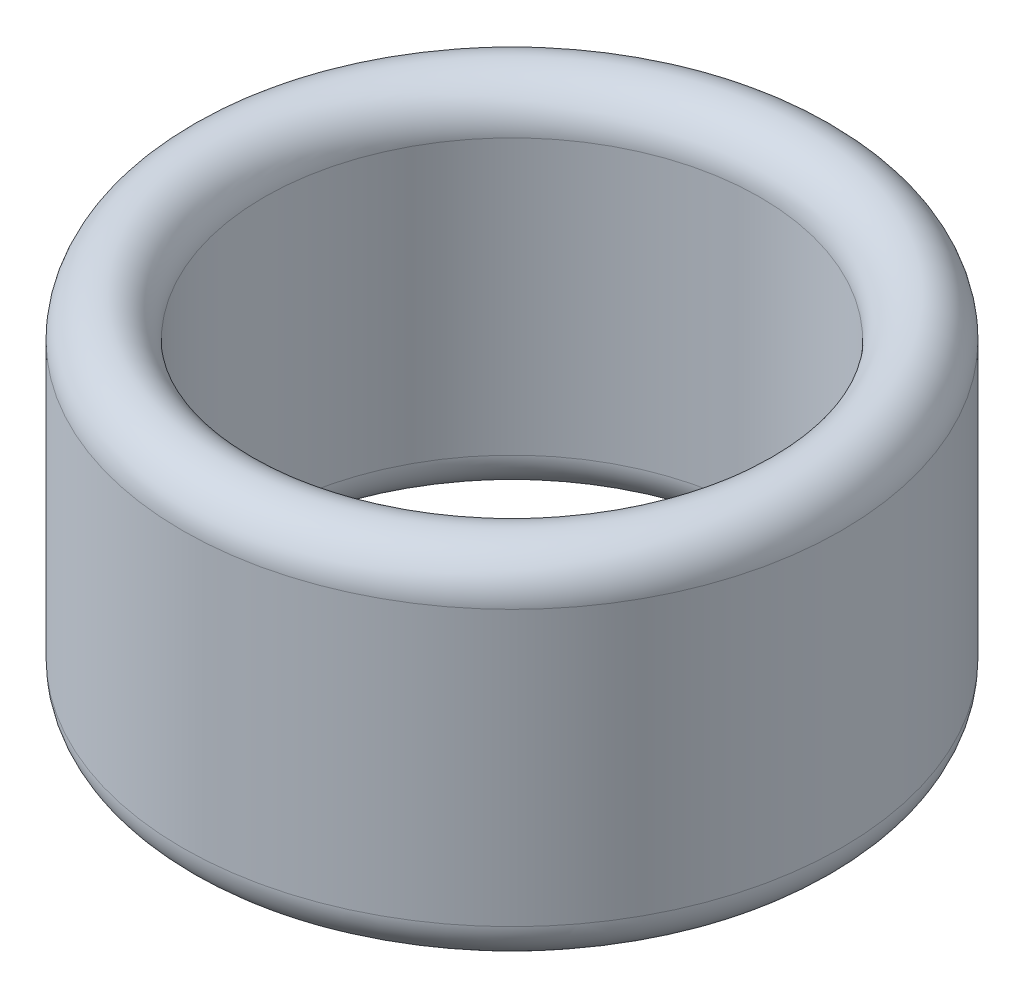
ISO-10303-21;
HEADER;
FILE_DESCRIPTION(('STEP AP214'),'2;1');
FILE_NAME('part.step','',(''),(''),'','','');
FILE_SCHEMA(('AUTOMOTIVE_DESIGN { 1 0 10303 214 1 1 1 1 }'));
ENDSEC;
DATA;
#1=APPLICATION_CONTEXT('core data for automotive mechanical design processes');
#2=APPLICATION_PROTOCOL_DEFINITION('international standard','automotive_design',2000,#1);
#3=PRODUCT_CONTEXT('',#1,'mechanical');
#4=PRODUCT('Part','Part','',(#3));
#5=PRODUCT_RELATED_PRODUCT_CATEGORY('part','',(#4));
#6=PRODUCT_DEFINITION_FORMATION('','',#4);
#7=PRODUCT_DEFINITION_CONTEXT('part definition',#1,'design');
#8=PRODUCT_DEFINITION('design','',#6,#7);
#9=PRODUCT_DEFINITION_SHAPE('','',#8);
#10=(LENGTH_UNIT() NAMED_UNIT(*) SI_UNIT(.MILLI.,.METRE.));
#11=(NAMED_UNIT(*) PLANE_ANGLE_UNIT() SI_UNIT($,.RADIAN.));
#12=(NAMED_UNIT(*) SI_UNIT($,.STERADIAN.) SOLID_ANGLE_UNIT());
#13=UNCERTAINTY_MEASURE_WITH_UNIT(LENGTH_MEASURE(1.E-05),#10,'distance_accuracy_value','');
#14=(GEOMETRIC_REPRESENTATION_CONTEXT(3) GLOBAL_UNCERTAINTY_ASSIGNED_CONTEXT((#13)) GLOBAL_UNIT_ASSIGNED_CONTEXT((#10,
#11,#12)) REPRESENTATION_CONTEXT('',''));
#15=CARTESIAN_POINT('',(0.,0.,0.));
#16=DIRECTION('',(0.,0.,1.));
#17=DIRECTION('',(1.,0.,0.));
#18=AXIS2_PLACEMENT_3D('',#15,#16,#17);
#19=CARTESIAN_POINT('',(0.,0.4445,0.));
#20=DIRECTION('',(0.,1.,0.));
#21=DIRECTION('',(0.,0.,1.));
#22=AXIS2_PLACEMENT_3D('',#19,#20,#21);
#23=TOROIDAL_SURFACE('',#22,3.1496,0.4445);
#24=CARTESIAN_POINT('',(0.,0.4445,0.));
#25=DIRECTION('',(0.,1.,0.));
#26=DIRECTION('',(0.,0.,1.));
#27=AXIS2_PLACEMENT_3D('',#24,#25,#26);
#28=CIRCLE('',#27,3.5941);
#29=CARTESIAN_POINT('',(0.,0.4445,-3.5941));
#30=VERTEX_POINT('',#29);
#31=EDGE_CURVE('E57',#30,#30,#28,.T.);
#32=ORIENTED_EDGE('',*,*,#31,.F.);
#33=EDGE_LOOP('',(#32));
#34=FACE_BOUND('',#33,.T.);
#35=CARTESIAN_POINT('',(0.,0.4445,0.));
#36=DIRECTION('',(0.,1.,0.));
#37=DIRECTION('',(0.,0.,1.));
#38=AXIS2_PLACEMENT_3D('',#35,#36,#37);
#39=CIRCLE('',#38,2.7051);
#40=CARTESIAN_POINT('',(0.,0.4445,2.7051));
#41=VERTEX_POINT('',#40);
#42=EDGE_CURVE('E12',#41,#41,#39,.F.);
#43=ORIENTED_EDGE('',*,*,#42,.F.);
#44=EDGE_LOOP('',(#43));
#45=FACE_BOUND('',#44,.T.);
#46=ADVANCED_FACE('F50',(#34,#45),#23,.T.);
#47=CARTESIAN_POINT('',(0.,3.4417,0.));
#48=DIRECTION('',(0.,1.,0.));
#49=DIRECTION('',(0.,0.,1.));
#50=AXIS2_PLACEMENT_3D('',#47,#48,#49);
#51=TOROIDAL_SURFACE('',#50,3.1496,0.4445);
#52=CARTESIAN_POINT('',(0.,3.4417,0.));
#53=DIRECTION('',(0.,1.,0.));
#54=DIRECTION('',(0.,0.,1.));
#55=AXIS2_PLACEMENT_3D('',#52,#53,#54);
#56=CIRCLE('',#55,2.7051);
#57=CARTESIAN_POINT('',(0.,3.4417,2.7051));
#58=VERTEX_POINT('',#57);
#59=EDGE_CURVE('E65',#58,#58,#56,.T.);
#60=ORIENTED_EDGE('',*,*,#59,.F.);
#61=EDGE_LOOP('',(#60));
#62=FACE_BOUND('',#61,.T.);
#63=CARTESIAN_POINT('',(0.,3.4417,0.));
#64=DIRECTION('',(0.,1.,0.));
#65=DIRECTION('',(0.,0.,1.));
#66=AXIS2_PLACEMENT_3D('',#63,#64,#65);
#67=CIRCLE('',#66,3.5941);
#68=CARTESIAN_POINT('',(0.,3.4417,-3.5941));
#69=VERTEX_POINT('',#68);
#70=EDGE_CURVE('E61',#69,#69,#67,.F.);
#71=ORIENTED_EDGE('',*,*,#70,.F.);
#72=EDGE_LOOP('',(#71));
#73=FACE_BOUND('',#72,.T.);
#74=ADVANCED_FACE('F73',(#62,#73),#51,.T.);
#75=CARTESIAN_POINT('',(0.,3.8862,0.));
#76=DIRECTION('',(0.,-1.,0.));
#77=DIRECTION('',(0.,0.,-1.));
#78=AXIS2_PLACEMENT_3D('',#75,#76,#77);
#79=CYLINDRICAL_SURFACE('',#78,3.5941);
#80=CARTESIAN_POINT('',(0.,0.4445,-3.5941));
#81=CARTESIAN_POINT('',(0.,0.475720833333333,-3.5941));
#82=CARTESIAN_POINT('',(0.,0.506941666666666,-3.5941));
#83=CARTESIAN_POINT('',(0.,0.569383333333333,-3.5941));
#84=CARTESIAN_POINT('',(0.,0.600604166666666,-3.5941));
#85=CARTESIAN_POINT('',(0.,0.663045833333333,-3.5941));
#86=CARTESIAN_POINT('',(0.,0.694266666666666,-3.5941));
#87=CARTESIAN_POINT('',(0.,0.756708333333333,-3.5941));
#88=CARTESIAN_POINT('',(0.,0.787929166666666,-3.5941));
#89=CARTESIAN_POINT('',(0.,0.850370833333333,-3.5941));
#90=CARTESIAN_POINT('',(0.,0.881591666666666,-3.5941));
#91=CARTESIAN_POINT('',(0.,0.944033333333333,-3.5941));
#92=CARTESIAN_POINT('',(0.,0.975254166666666,-3.5941));
#93=CARTESIAN_POINT('',(0.,1.03769583333333,-3.5941));
#94=CARTESIAN_POINT('',(0.,1.06891666666667,-3.5941));
#95=CARTESIAN_POINT('',(0.,1.13135833333333,-3.5941));
#96=CARTESIAN_POINT('',(0.,1.16257916666667,-3.5941));
#97=CARTESIAN_POINT('',(0.,1.22502083333333,-3.5941));
#98=CARTESIAN_POINT('',(0.,1.25624166666667,-3.5941));
#99=CARTESIAN_POINT('',(0.,1.31868333333333,-3.5941));
#100=CARTESIAN_POINT('',(0.,1.34990416666667,-3.5941));
#101=CARTESIAN_POINT('',(0.,1.41234583333333,-3.5941));
#102=CARTESIAN_POINT('',(0.,1.44356666666667,-3.5941));
#103=CARTESIAN_POINT('',(0.,1.50600833333333,-3.5941));
#104=CARTESIAN_POINT('',(0.,1.53722916666667,-3.5941));
#105=CARTESIAN_POINT('',(0.,1.59967083333333,-3.5941));
#106=CARTESIAN_POINT('',(0.,1.63089166666667,-3.5941));
#107=CARTESIAN_POINT('',(0.,1.69333333333333,-3.5941));
#108=CARTESIAN_POINT('',(0.,1.72455416666667,-3.5941));
#109=CARTESIAN_POINT('',(0.,1.78699583333333,-3.5941));
#110=CARTESIAN_POINT('',(0.,1.81821666666667,-3.5941));
#111=CARTESIAN_POINT('',(0.,1.88065833333333,-3.5941));
#112=CARTESIAN_POINT('',(0.,1.91187916666667,-3.5941));
#113=CARTESIAN_POINT('',(0.,1.97432083333333,-3.5941));
#114=CARTESIAN_POINT('',(0.,2.00554166666667,-3.5941));
#115=CARTESIAN_POINT('',(0.,2.06798333333333,-3.5941));
#116=CARTESIAN_POINT('',(0.,2.09920416666667,-3.5941));
#117=CARTESIAN_POINT('',(0.,2.16164583333333,-3.5941));
#118=CARTESIAN_POINT('',(0.,2.19286666666667,-3.5941));
#119=CARTESIAN_POINT('',(0.,2.25530833333333,-3.5941));
#120=CARTESIAN_POINT('',(0.,2.28652916666667,-3.5941));
#121=CARTESIAN_POINT('',(0.,2.34897083333333,-3.5941));
#122=CARTESIAN_POINT('',(0.,2.38019166666667,-3.5941));
#123=CARTESIAN_POINT('',(0.,2.44263333333333,-3.5941));
#124=CARTESIAN_POINT('',(0.,2.47385416666667,-3.5941));
#125=CARTESIAN_POINT('',(0.,2.53629583333333,-3.5941));
#126=CARTESIAN_POINT('',(0.,2.56751666666667,-3.5941));
#127=CARTESIAN_POINT('',(0.,2.62995833333333,-3.5941));
#128=CARTESIAN_POINT('',(0.,2.66117916666667,-3.5941));
#129=CARTESIAN_POINT('',(0.,2.72362083333333,-3.5941));
#130=CARTESIAN_POINT('',(0.,2.75484166666667,-3.5941));
#131=CARTESIAN_POINT('',(0.,2.81728333333333,-3.5941));
#132=CARTESIAN_POINT('',(0.,2.84850416666667,-3.5941));
#133=CARTESIAN_POINT('',(0.,2.91094583333333,-3.5941));
#134=CARTESIAN_POINT('',(0.,2.94216666666667,-3.5941));
#135=CARTESIAN_POINT('',(0.,3.00460833333333,-3.5941));
#136=CARTESIAN_POINT('',(0.,3.03582916666667,-3.5941));
#137=CARTESIAN_POINT('',(0.,3.09827083333333,-3.5941));
#138=CARTESIAN_POINT('',(0.,3.12949166666667,-3.5941));
#139=CARTESIAN_POINT('',(0.,3.19193333333333,-3.5941));
#140=CARTESIAN_POINT('',(0.,3.22315416666667,-3.5941));
#141=CARTESIAN_POINT('',(0.,3.28559583333333,-3.5941));
#142=CARTESIAN_POINT('',(0.,3.31681666666667,-3.5941));
#143=CARTESIAN_POINT('',(0.,3.37925833333333,-3.5941));
#144=CARTESIAN_POINT('',(0.,3.41047916666667,-3.5941));
#145=CARTESIAN_POINT('',(0.,3.4417,-3.5941));
#146=B_SPLINE_CURVE_WITH_KNOTS('',3,(#80,#81,#82,#83,#84,#85,#86,#87,#88,#89,#90,#91,#92,#93,
#94,#95,#96,#97,#98,#99,#100,#101,#102,#103,#104,#105,#106,#107,#108,#109,#110,#111,#112,#113,
#114,#115,#116,#117,#118,#119,#120,#121,#122,#123,#124,#125,#126,#127,#128,#129,#130,#131,#132,
#133,#134,#135,#136,#137,#138,#139,#140,#141,#142,#143,#144,#145),.UNSPECIFIED.,.F.,.F.,(4,2,2,
2,2,2,2,2,2,2,2,2,2,2,2,2,2,2,2,2,2,2,2,2,2,2,2,2,2,2,2,2,4),(0.,0.0936625000000002,0.187325,
0.2809875,0.37465,0.4683125,0.561975,0.6556375,0.7493,0.8429625,0.936625,1.0302875,1.12395,
1.2176125,1.311275,1.4049375,1.4986,1.5922625,1.685925,1.7795875,1.87325,1.9669125,2.060575,
2.1542375,2.2479,2.3415625,2.435225,2.5288875,2.62255,2.7162125,2.809875,2.9035375,2.9972),.UNSPECIFIED.);
#147=EDGE_CURVE('BSEAM76',#30,#69,#146,.T.);
#148=ORIENTED_EDGE('',*,*,#31,.T.);
#149=ORIENTED_EDGE('',*,*,#70,.T.);
#150=ORIENTED_EDGE('',*,*,#147,.T.);
#151=ORIENTED_EDGE('',*,*,#147,.F.);
#152=EDGE_LOOP('',(#148,#150,#149,#151));
#153=FACE_BOUND('',#152,.T.);
#154=ADVANCED_FACE('F76',(#153),#79,.T.);
#155=CARTESIAN_POINT('',(0.,0.,0.));
#156=DIRECTION('',(0.,1.,0.));
#157=DIRECTION('',(0.,0.,1.));
#158=AXIS2_PLACEMENT_3D('',#155,#156,#157);
#159=CYLINDRICAL_SURFACE('',#158,2.7051);
#160=CARTESIAN_POINT('',(0.,0.4445,2.7051));
#161=CARTESIAN_POINT('',(0.,0.475720833333333,2.7051));
#162=CARTESIAN_POINT('',(0.,0.506941666666666,2.7051));
#163=CARTESIAN_POINT('',(0.,0.569383333333333,2.7051));
#164=CARTESIAN_POINT('',(0.,0.600604166666666,2.7051));
#165=CARTESIAN_POINT('',(0.,0.663045833333333,2.7051));
#166=CARTESIAN_POINT('',(0.,0.694266666666666,2.7051));
#167=CARTESIAN_POINT('',(0.,0.756708333333333,2.7051));
#168=CARTESIAN_POINT('',(0.,0.787929166666666,2.7051));
#169=CARTESIAN_POINT('',(0.,0.850370833333333,2.7051));
#170=CARTESIAN_POINT('',(0.,0.881591666666666,2.7051));
#171=CARTESIAN_POINT('',(0.,0.944033333333333,2.7051));
#172=CARTESIAN_POINT('',(0.,0.975254166666666,2.7051));
#173=CARTESIAN_POINT('',(0.,1.03769583333333,2.7051));
#174=CARTESIAN_POINT('',(0.,1.06891666666667,2.7051));
#175=CARTESIAN_POINT('',(0.,1.13135833333333,2.7051));
#176=CARTESIAN_POINT('',(0.,1.16257916666667,2.7051));
#177=CARTESIAN_POINT('',(0.,1.22502083333333,2.7051));
#178=CARTESIAN_POINT('',(0.,1.25624166666667,2.7051));
#179=CARTESIAN_POINT('',(0.,1.31868333333333,2.7051));
#180=CARTESIAN_POINT('',(0.,1.34990416666667,2.7051));
#181=CARTESIAN_POINT('',(0.,1.41234583333333,2.7051));
#182=CARTESIAN_POINT('',(0.,1.44356666666667,2.7051));
#183=CARTESIAN_POINT('',(0.,1.50600833333333,2.7051));
#184=CARTESIAN_POINT('',(0.,1.53722916666667,2.7051));
#185=CARTESIAN_POINT('',(0.,1.59967083333333,2.7051));
#186=CARTESIAN_POINT('',(0.,1.63089166666667,2.7051));
#187=CARTESIAN_POINT('',(0.,1.69333333333333,2.7051));
#188=CARTESIAN_POINT('',(0.,1.72455416666667,2.7051));
#189=CARTESIAN_POINT('',(0.,1.78699583333333,2.7051));
#190=CARTESIAN_POINT('',(0.,1.81821666666667,2.7051));
#191=CARTESIAN_POINT('',(0.,1.88065833333333,2.7051));
#192=CARTESIAN_POINT('',(0.,1.91187916666667,2.7051));
#193=CARTESIAN_POINT('',(0.,1.97432083333333,2.7051));
#194=CARTESIAN_POINT('',(0.,2.00554166666667,2.7051));
#195=CARTESIAN_POINT('',(0.,2.06798333333333,2.7051));
#196=CARTESIAN_POINT('',(0.,2.09920416666667,2.7051));
#197=CARTESIAN_POINT('',(0.,2.16164583333333,2.7051));
#198=CARTESIAN_POINT('',(0.,2.19286666666667,2.7051));
#199=CARTESIAN_POINT('',(0.,2.25530833333333,2.7051));
#200=CARTESIAN_POINT('',(0.,2.28652916666667,2.7051));
#201=CARTESIAN_POINT('',(0.,2.34897083333333,2.7051));
#202=CARTESIAN_POINT('',(0.,2.38019166666667,2.7051));
#203=CARTESIAN_POINT('',(0.,2.44263333333333,2.7051));
#204=CARTESIAN_POINT('',(0.,2.47385416666667,2.7051));
#205=CARTESIAN_POINT('',(0.,2.53629583333333,2.7051));
#206=CARTESIAN_POINT('',(0.,2.56751666666667,2.7051));
#207=CARTESIAN_POINT('',(0.,2.62995833333333,2.7051));
#208=CARTESIAN_POINT('',(0.,2.66117916666667,2.7051));
#209=CARTESIAN_POINT('',(0.,2.72362083333333,2.7051));
#210=CARTESIAN_POINT('',(0.,2.75484166666667,2.7051));
#211=CARTESIAN_POINT('',(0.,2.81728333333333,2.7051));
#212=CARTESIAN_POINT('',(0.,2.84850416666667,2.7051));
#213=CARTESIAN_POINT('',(0.,2.91094583333333,2.7051));
#214=CARTESIAN_POINT('',(0.,2.94216666666667,2.7051));
#215=CARTESIAN_POINT('',(0.,3.00460833333333,2.7051));
#216=CARTESIAN_POINT('',(0.,3.03582916666667,2.7051));
#217=CARTESIAN_POINT('',(0.,3.09827083333333,2.7051));
#218=CARTESIAN_POINT('',(0.,3.12949166666667,2.7051));
#219=CARTESIAN_POINT('',(0.,3.19193333333333,2.7051));
#220=CARTESIAN_POINT('',(0.,3.22315416666667,2.7051));
#221=CARTESIAN_POINT('',(0.,3.28559583333333,2.7051));
#222=CARTESIAN_POINT('',(0.,3.31681666666667,2.7051));
#223=CARTESIAN_POINT('',(0.,3.37925833333333,2.7051));
#224=CARTESIAN_POINT('',(0.,3.41047916666667,2.7051));
#225=CARTESIAN_POINT('',(0.,3.4417,2.7051));
#226=B_SPLINE_CURVE_WITH_KNOTS('',3,(#160,#161,#162,#163,#164,#165,#166,#167,#168,#169,#170,
#171,#172,#173,#174,#175,#176,#177,#178,#179,#180,#181,#182,#183,#184,#185,#186,#187,#188,#189,
#190,#191,#192,#193,#194,#195,#196,#197,#198,#199,#200,#201,#202,#203,#204,#205,#206,#207,#208,
#209,#210,#211,#212,#213,#214,#215,#216,#217,#218,#219,#220,#221,#222,#223,#224,#225),
.UNSPECIFIED.,.F.,.F.,(4,2,2,2,2,2,2,2,2,2,2,2,2,2,2,2,2,2,2,2,2,2,2,2,2,2,2,2,2,2,2,2,4),(0.,
0.0936624999999999,0.187325,0.2809875,0.37465,0.4683125,0.561975,0.6556375,0.7493,0.8429625,
0.936625,1.0302875,1.12395,1.2176125,1.311275,1.4049375,1.4986,1.5922625,1.685925,1.7795875,
1.87325,1.9669125,2.060575,2.1542375,2.2479,2.3415625,2.435225,2.5288875,2.62255,2.7162125,
2.809875,2.9035375,2.9972),.UNSPECIFIED.);
#227=EDGE_CURVE('BSEAM71',#41,#58,#226,.T.);
#228=ORIENTED_EDGE('',*,*,#42,.T.);
#229=ORIENTED_EDGE('',*,*,#59,.T.);
#230=ORIENTED_EDGE('',*,*,#227,.T.);
#231=ORIENTED_EDGE('',*,*,#227,.F.);
#232=EDGE_LOOP('',(#228,#230,#229,#231));
#233=FACE_BOUND('',#232,.T.);
#234=ADVANCED_FACE('F71',(#233),#159,.F.);
#235=CLOSED_SHELL('',(#46,#74,#154,#234));
#236=MANIFOLD_SOLID_BREP('B2',#235);
#237=ADVANCED_BREP_SHAPE_REPRESENTATION('',(#18,#236),#14);
#238=SHAPE_DEFINITION_REPRESENTATION(#9,#237);
ENDSEC;
END-ISO-10303-21;
